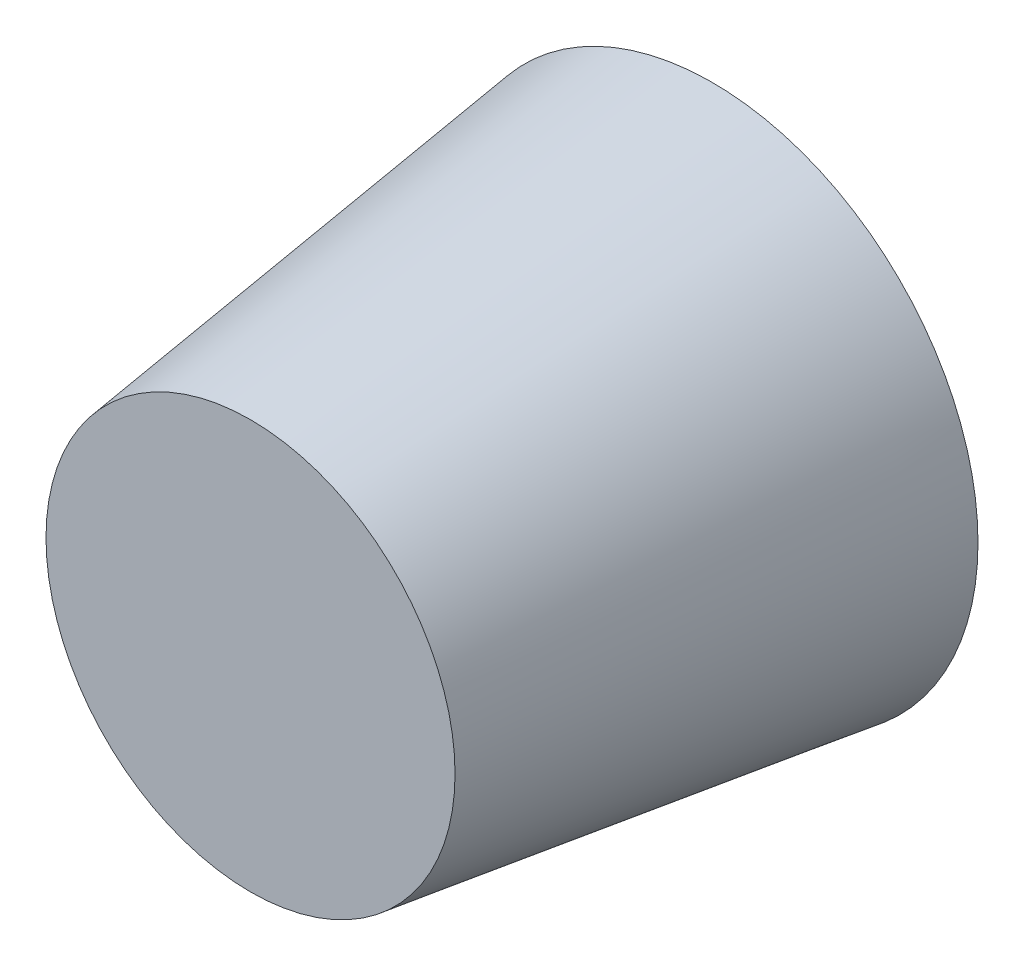
ISO-10303-21;
HEADER;
FILE_DESCRIPTION(('STEP AP214'),'2;1');
FILE_NAME('part.step','',(''),(''),'','','');
FILE_SCHEMA(('AUTOMOTIVE_DESIGN { 1 0 10303 214 1 1 1 1 }'));
ENDSEC;
DATA;
#1=APPLICATION_CONTEXT('core data for automotive mechanical design processes');
#2=APPLICATION_PROTOCOL_DEFINITION('international standard','automotive_design',2000,#1);
#3=PRODUCT_CONTEXT('',#1,'mechanical');
#4=PRODUCT('Part','Part','',(#3));
#5=PRODUCT_RELATED_PRODUCT_CATEGORY('part','',(#4));
#6=PRODUCT_DEFINITION_FORMATION('','',#4);
#7=PRODUCT_DEFINITION_CONTEXT('part definition',#1,'design');
#8=PRODUCT_DEFINITION('design','',#6,#7);
#9=PRODUCT_DEFINITION_SHAPE('','',#8);
#10=(LENGTH_UNIT() NAMED_UNIT(*) SI_UNIT(.MILLI.,.METRE.));
#11=(NAMED_UNIT(*) PLANE_ANGLE_UNIT() SI_UNIT($,.RADIAN.));
#12=(NAMED_UNIT(*) SI_UNIT($,.STERADIAN.) SOLID_ANGLE_UNIT());
#13=UNCERTAINTY_MEASURE_WITH_UNIT(LENGTH_MEASURE(1.E-05),#10,'distance_accuracy_value','');
#14=(GEOMETRIC_REPRESENTATION_CONTEXT(3) GLOBAL_UNCERTAINTY_ASSIGNED_CONTEXT((#13)) GLOBAL_UNIT_ASSIGNED_CONTEXT((#10,
#11,#12)) REPRESENTATION_CONTEXT('',''));
#15=CARTESIAN_POINT('',(0.,0.,0.));
#16=DIRECTION('',(0.,0.,1.));
#17=DIRECTION('',(1.,0.,0.));
#18=AXIS2_PLACEMENT_3D('',#15,#16,#17);
#19=CARTESIAN_POINT('',(0.,0.,0.));
#20=DIRECTION('',(0.,0.,1.));
#21=DIRECTION('',(1.,0.,0.));
#22=AXIS2_PLACEMENT_3D('',#19,#20,#21);
#23=PLANE('',#22);
#24=CARTESIAN_POINT('',(0.,0.,0.));
#25=DIRECTION('',(0.,0.,1.));
#26=DIRECTION('',(1.,0.,0.));
#27=AXIS2_PLACEMENT_3D('',#24,#25,#26);
#28=CIRCLE('',#27,15.5);
#29=CARTESIAN_POINT('',(15.5,0.,0.));
#30=VERTEX_POINT('',#29);
#31=EDGE_CURVE('E10',#30,#30,#28,.T.);
#32=ORIENTED_EDGE('',*,*,#31,.T.);
#33=EDGE_LOOP('',(#32));
#34=FACE_BOUND('',#33,.T.);
#35=ADVANCED_FACE('F37',(#34),#23,.T.);
#36=CARTESIAN_POINT('',(0.,0.,0.));
#37=DIRECTION('',(0.,0.,-1.));
#38=DIRECTION('',(-1.,0.,0.));
#39=AXIS2_PLACEMENT_3D('',#36,#37,#38);
#40=CONICAL_SURFACE('',#39,15.5,0.131588141457921);
#41=CARTESIAN_POINT('',(0.,0.,-35.));
#42=DIRECTION('',(0.,0.,1.));
#43=DIRECTION('',(1.,0.,0.));
#44=AXIS2_PLACEMENT_3D('',#41,#42,#43);
#45=CIRCLE('',#44,20.1323529411765);
#46=CARTESIAN_POINT('',(20.1323529411765,0.,-35.));
#47=VERTEX_POINT('',#46);
#48=EDGE_CURVE('E44',#47,#47,#45,.T.);
#49=ORIENTED_EDGE('',*,*,#48,.T.);
#50=EDGE_LOOP('',(#49));
#51=FACE_BOUND('',#50,.T.);
#52=ORIENTED_EDGE('',*,*,#31,.F.);
#53=EDGE_LOOP('',(#52));
#54=FACE_BOUND('',#53,.T.);
#55=ADVANCED_FACE('F73',(#51,#54),#40,.T.);
#56=CARTESIAN_POINT('',(20.1323529411765,0.,-35.));
#57=DIRECTION('',(0.,0.,-1.));
#58=DIRECTION('',(-1.,0.,0.));
#59=AXIS2_PLACEMENT_3D('',#56,#57,#58);
#60=PLANE('',#59);
#61=CARTESIAN_POINT('',(0.,0.,-35.));
#62=DIRECTION('',(0.,0.,1.));
#63=DIRECTION('',(1.,0.,0.));
#64=AXIS2_PLACEMENT_3D('',#61,#62,#63);
#65=CIRCLE('',#64,19.);
#66=CARTESIAN_POINT('',(19.,0.,-35.));
#67=VERTEX_POINT('',#66);
#68=EDGE_CURVE('E49',#67,#67,#65,.T.);
#69=ORIENTED_EDGE('',*,*,#68,.T.);
#70=EDGE_LOOP('',(#69));
#71=FACE_BOUND('',#70,.T.);
#72=ORIENTED_EDGE('',*,*,#48,.F.);
#73=EDGE_LOOP('',(#72));
#74=FACE_BOUND('',#73,.T.);
#75=ADVANCED_FACE('F70',(#71,#74),#60,.T.);
#76=CARTESIAN_POINT('',(0.,0.,-35.));
#77=DIRECTION('',(0.,0.,-1.));
#78=DIRECTION('',(-1.,0.,0.));
#79=AXIS2_PLACEMENT_3D('',#76,#77,#78);
#80=CONICAL_SURFACE('',#79,19.,0.131588141457921);
#81=CARTESIAN_POINT('',(0.,0.,-1.));
#82=DIRECTION('',(0.,0.,1.));
#83=DIRECTION('',(1.,0.,0.));
#84=AXIS2_PLACEMENT_3D('',#81,#82,#83);
#85=CIRCLE('',#84,14.5);
#86=CARTESIAN_POINT('',(14.5,0.,-1.));
#87=VERTEX_POINT('',#86);
#88=EDGE_CURVE('E54',#87,#87,#85,.T.);
#89=ORIENTED_EDGE('',*,*,#88,.T.);
#90=EDGE_LOOP('',(#89));
#91=FACE_BOUND('',#90,.T.);
#92=ORIENTED_EDGE('',*,*,#68,.F.);
#93=EDGE_LOOP('',(#92));
#94=FACE_BOUND('',#93,.T.);
#95=ADVANCED_FACE('F61',(#91,#94),#80,.F.);
#96=CARTESIAN_POINT('',(0.,0.,-1.));
#97=DIRECTION('',(0.,0.,-1.));
#98=DIRECTION('',(-1.,0.,0.));
#99=AXIS2_PLACEMENT_3D('',#96,#97,#98);
#100=PLANE('',#99);
#101=ORIENTED_EDGE('',*,*,#88,.F.);
#102=EDGE_LOOP('',(#101));
#103=FACE_BOUND('',#102,.T.);
#104=ADVANCED_FACE('F64',(#103),#100,.T.);
#105=CLOSED_SHELL('',(#35,#55,#75,#95,#104));
#106=MANIFOLD_SOLID_BREP('B2',#105);
#107=ADVANCED_BREP_SHAPE_REPRESENTATION('',(#18,#106),#14);
#108=SHAPE_DEFINITION_REPRESENTATION(#9,#107);
ENDSEC;
END-ISO-10303-21;
